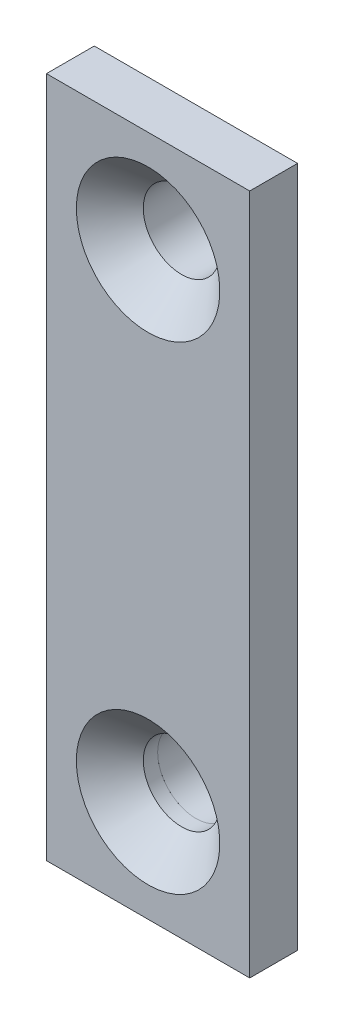
ISO-10303-21;
HEADER;
FILE_DESCRIPTION(('STEP AP214'),'2;1');
FILE_NAME('part.step','',(''),(''),'','','');
FILE_SCHEMA(('AUTOMOTIVE_DESIGN { 1 0 10303 214 1 1 1 1 }'));
ENDSEC;
DATA;
#1=APPLICATION_CONTEXT('core data for automotive mechanical design processes');
#2=APPLICATION_PROTOCOL_DEFINITION('international standard','automotive_design',2000,#1);
#3=PRODUCT_CONTEXT('',#1,'mechanical');
#4=PRODUCT('Part','Part','',(#3));
#5=PRODUCT_RELATED_PRODUCT_CATEGORY('part','',(#4));
#6=PRODUCT_DEFINITION_FORMATION('','',#4);
#7=PRODUCT_DEFINITION_CONTEXT('part definition',#1,'design');
#8=PRODUCT_DEFINITION('design','',#6,#7);
#9=PRODUCT_DEFINITION_SHAPE('','',#8);
#10=(LENGTH_UNIT() NAMED_UNIT(*) SI_UNIT(.MILLI.,.METRE.));
#11=(NAMED_UNIT(*) PLANE_ANGLE_UNIT() SI_UNIT($,.RADIAN.));
#12=(NAMED_UNIT(*) SI_UNIT($,.STERADIAN.) SOLID_ANGLE_UNIT());
#13=UNCERTAINTY_MEASURE_WITH_UNIT(LENGTH_MEASURE(1.E-05),#10,'distance_accuracy_value','');
#14=(GEOMETRIC_REPRESENTATION_CONTEXT(3) GLOBAL_UNCERTAINTY_ASSIGNED_CONTEXT((#13)) GLOBAL_UNIT_ASSIGNED_CONTEXT((#10,
#11,#12)) REPRESENTATION_CONTEXT('',''));
#15=CARTESIAN_POINT('',(0.,0.,0.));
#16=DIRECTION('',(0.,0.,1.));
#17=DIRECTION('',(1.,0.,0.));
#18=AXIS2_PLACEMENT_3D('',#15,#16,#17);
#19=CARTESIAN_POINT('',(0.,-7.5,2.));
#20=DIRECTION('',(0.,1.,0.));
#21=DIRECTION('',(0.,0.,1.));
#22=AXIS2_PLACEMENT_3D('',#19,#20,#21);
#23=PLANE('',#22);
#24=DIRECTION('',(1.,0.,0.));
#25=VECTOR('',#24,1.);
#26=CARTESIAN_POINT('',(0.,-7.5,0.));
#27=LINE('',#26,#25);
#28=CARTESIAN_POINT('',(-2.25,-7.5,0.));
#29=VERTEX_POINT('',#28);
#30=CARTESIAN_POINT('',(2.25,-7.5,0.));
#31=VERTEX_POINT('',#30);
#32=EDGE_CURVE('E156',#29,#31,#27,.T.);
#33=ORIENTED_EDGE('',*,*,#32,.F.);
#34=DIRECTION('',(0.,0.,-1.));
#35=VECTOR('',#34,1.);
#36=CARTESIAN_POINT('',(-2.25,-7.5,2.));
#37=LINE('',#36,#35);
#38=CARTESIAN_POINT('',(-2.25,-7.5,2.));
#39=VERTEX_POINT('',#38);
#40=EDGE_CURVE('E13',#39,#29,#37,.T.);
#41=ORIENTED_EDGE('',*,*,#40,.F.);
#42=DIRECTION('',(1.,0.,0.));
#43=VECTOR('',#42,1.);
#44=CARTESIAN_POINT('',(0.,-7.5,2.));
#45=LINE('',#44,#43);
#46=CARTESIAN_POINT('',(2.25,-7.5,2.));
#47=VERTEX_POINT('',#46);
#48=EDGE_CURVE('E146',#39,#47,#45,.T.);
#49=ORIENTED_EDGE('',*,*,#48,.T.);
#50=DIRECTION('',(0.,0.,-1.));
#51=VECTOR('',#50,1.);
#52=CARTESIAN_POINT('',(2.25,-7.5,2.));
#53=LINE('',#52,#51);
#54=EDGE_CURVE('E125',#47,#31,#53,.T.);
#55=ORIENTED_EDGE('',*,*,#54,.T.);
#56=EDGE_LOOP('',(#33,#41,#49,#55));
#57=FACE_BOUND('',#56,.T.);
#58=ADVANCED_FACE('F85',(#57),#23,.T.);
#59=CARTESIAN_POINT('',(-2.25,0.,2.));
#60=DIRECTION('',(-1.,0.,0.));
#61=DIRECTION('',(0.,0.,1.));
#62=AXIS2_PLACEMENT_3D('',#59,#60,#61);
#63=PLANE('',#62);
#64=DIRECTION('',(0.,1.,0.));
#65=VECTOR('',#64,1.);
#66=CARTESIAN_POINT('',(-2.25,0.,0.));
#67=LINE('',#66,#65);
#68=CARTESIAN_POINT('',(-2.25,-12.25,0.));
#69=VERTEX_POINT('',#68);
#70=EDGE_CURVE('E137',#69,#29,#67,.T.);
#71=ORIENTED_EDGE('',*,*,#70,.F.);
#72=DIRECTION('',(0.,0.,-1.));
#73=VECTOR('',#72,1.);
#74=CARTESIAN_POINT('',(-2.25,-12.25,2.));
#75=LINE('',#74,#73);
#76=CARTESIAN_POINT('',(-2.25,-12.25,2.));
#77=VERTEX_POINT('',#76);
#78=EDGE_CURVE('E94',#77,#69,#75,.T.);
#79=ORIENTED_EDGE('',*,*,#78,.F.);
#80=DIRECTION('',(0.,1.,0.));
#81=VECTOR('',#80,1.);
#82=CARTESIAN_POINT('',(-2.25,0.,2.));
#83=LINE('',#82,#81);
#84=EDGE_CURVE('E135',#77,#39,#83,.T.);
#85=ORIENTED_EDGE('',*,*,#84,.T.);
#86=ORIENTED_EDGE('',*,*,#40,.T.);
#87=EDGE_LOOP('',(#71,#79,#85,#86));
#88=FACE_BOUND('',#87,.T.);
#89=ADVANCED_FACE('F133',(#88),#63,.T.);
#90=CARTESIAN_POINT('',(0.,-12.25,2.));
#91=DIRECTION('',(0.,1.,0.));
#92=DIRECTION('',(0.,0.,1.));
#93=AXIS2_PLACEMENT_3D('',#90,#91,#92);
#94=PLANE('',#93);
#95=DIRECTION('',(1.,0.,0.));
#96=VECTOR('',#95,1.);
#97=CARTESIAN_POINT('',(0.,-12.25,0.));
#98=LINE('',#97,#96);
#99=CARTESIAN_POINT('',(2.25,-12.25,0.));
#100=VERTEX_POINT('',#99);
#101=EDGE_CURVE('E159',#69,#100,#98,.T.);
#102=ORIENTED_EDGE('',*,*,#101,.T.);
#103=DIRECTION('',(0.,0.,-1.));
#104=VECTOR('',#103,1.);
#105=CARTESIAN_POINT('',(2.25,-12.25,2.));
#106=LINE('',#105,#104);
#107=CARTESIAN_POINT('',(2.25,-12.25,2.));
#108=VERTEX_POINT('',#107);
#109=EDGE_CURVE('E140',#108,#100,#106,.T.);
#110=ORIENTED_EDGE('',*,*,#109,.F.);
#111=DIRECTION('',(1.,0.,0.));
#112=VECTOR('',#111,1.);
#113=CARTESIAN_POINT('',(0.,-12.25,2.));
#114=LINE('',#113,#112);
#115=EDGE_CURVE('E142',#77,#108,#114,.T.);
#116=ORIENTED_EDGE('',*,*,#115,.F.);
#117=ORIENTED_EDGE('',*,*,#78,.T.);
#118=EDGE_LOOP('',(#102,#110,#116,#117));
#119=FACE_BOUND('',#118,.T.);
#120=ADVANCED_FACE('F143',(#119),#94,.F.);
#121=CARTESIAN_POINT('',(0.,-10.,2.));
#122=DIRECTION('',(0.,0.,-1.));
#123=DIRECTION('',(-1.,0.,0.));
#124=AXIS2_PLACEMENT_3D('',#121,#122,#123);
#125=CYLINDRICAL_SURFACE('',#124,1.6);
#126=CARTESIAN_POINT('',(0.,-10.,2.));
#127=DIRECTION('',(0.,0.,1.));
#128=DIRECTION('',(1.,0.,0.));
#129=AXIS2_PLACEMENT_3D('',#126,#127,#128);
#130=CIRCLE('',#129,1.6);
#131=CARTESIAN_POINT('',(1.6,-10.,2.));
#132=VERTEX_POINT('',#131);
#133=EDGE_CURVE('E148',#132,#132,#130,.T.);
#134=ORIENTED_EDGE('',*,*,#133,.T.);
#135=EDGE_LOOP('',(#134));
#136=FACE_BOUND('',#135,.T.);
#137=CARTESIAN_POINT('',(0.,-10.,0.));
#138=DIRECTION('',(0.,0.,1.));
#139=DIRECTION('',(1.,0.,0.));
#140=AXIS2_PLACEMENT_3D('',#137,#138,#139);
#141=CIRCLE('',#140,1.6);
#142=CARTESIAN_POINT('',(1.6,-10.,0.));
#143=VERTEX_POINT('',#142);
#144=EDGE_CURVE('E153',#143,#143,#141,.T.);
#145=ORIENTED_EDGE('',*,*,#144,.F.);
#146=EDGE_LOOP('',(#145));
#147=FACE_BOUND('',#146,.T.);
#148=ADVANCED_FACE('F87',(#136,#147),#125,.F.);
#149=CARTESIAN_POINT('',(2.25,0.,2.));
#150=DIRECTION('',(-1.,0.,0.));
#151=DIRECTION('',(0.,0.,1.));
#152=AXIS2_PLACEMENT_3D('',#149,#150,#151);
#153=PLANE('',#152);
#154=DIRECTION('',(0.,1.,0.));
#155=VECTOR('',#154,1.);
#156=CARTESIAN_POINT('',(2.25,0.,0.));
#157=LINE('',#156,#155);
#158=EDGE_CURVE('E118',#100,#31,#157,.T.);
#159=ORIENTED_EDGE('',*,*,#158,.T.);
#160=ORIENTED_EDGE('',*,*,#54,.F.);
#161=DIRECTION('',(0.,1.,0.));
#162=VECTOR('',#161,1.);
#163=CARTESIAN_POINT('',(2.25,0.,2.));
#164=LINE('',#163,#162);
#165=EDGE_CURVE('E102',#108,#47,#164,.T.);
#166=ORIENTED_EDGE('',*,*,#165,.F.);
#167=ORIENTED_EDGE('',*,*,#109,.T.);
#168=EDGE_LOOP('',(#159,#160,#166,#167));
#169=FACE_BOUND('',#168,.T.);
#170=ADVANCED_FACE('F164',(#169),#153,.F.);
#171=CARTESIAN_POINT('',(0.,0.,2.));
#172=DIRECTION('',(0.,0.,1.));
#173=DIRECTION('',(1.,0.,0.));
#174=AXIS2_PLACEMENT_3D('',#171,#172,#173);
#175=PLANE('',#174);
#176=ORIENTED_EDGE('',*,*,#133,.F.);
#177=EDGE_LOOP('',(#176));
#178=FACE_BOUND('',#177,.T.);
#179=ORIENTED_EDGE('',*,*,#48,.F.);
#180=ORIENTED_EDGE('',*,*,#84,.F.);
#181=ORIENTED_EDGE('',*,*,#115,.T.);
#182=ORIENTED_EDGE('',*,*,#165,.T.);
#183=EDGE_LOOP('',(#179,#180,#181,#182));
#184=FACE_BOUND('',#183,.T.);
#185=ADVANCED_FACE('F145',(#178,#184),#175,.T.);
#186=CARTESIAN_POINT('',(0.,0.,0.));
#187=DIRECTION('',(0.,0.,1.));
#188=DIRECTION('',(1.,0.,0.));
#189=AXIS2_PLACEMENT_3D('',#186,#187,#188);
#190=PLANE('',#189);
#191=ORIENTED_EDGE('',*,*,#144,.T.);
#192=EDGE_LOOP('',(#191));
#193=FACE_BOUND('',#192,.T.);
#194=ORIENTED_EDGE('',*,*,#32,.T.);
#195=ORIENTED_EDGE('',*,*,#158,.F.);
#196=ORIENTED_EDGE('',*,*,#101,.F.);
#197=ORIENTED_EDGE('',*,*,#70,.T.);
#198=EDGE_LOOP('',(#194,#195,#196,#197));
#199=FACE_BOUND('',#198,.T.);
#200=ADVANCED_FACE('F165',(#193,#199),#190,.F.);
#201=CLOSED_SHELL('',(#58,#89,#120,#148,#170,#185,#200));
#202=MANIFOLD_SOLID_BREP('B2',#201);
#203=CARTESIAN_POINT('',(-2.25,0.,2.));
#204=DIRECTION('',(-1.,0.,0.));
#205=DIRECTION('',(0.,0.,1.));
#206=AXIS2_PLACEMENT_3D('',#203,#204,#205);
#207=PLANE('',#206);
#208=DIRECTION('',(0.,1.,0.));
#209=VECTOR('',#208,1.);
#210=CARTESIAN_POINT('',(-2.25,0.,0.));
#211=LINE('',#210,#209);
#212=CARTESIAN_POINT('',(-2.25,7.5,0.));
#213=VERTEX_POINT('',#212);
#214=CARTESIAN_POINT('',(-2.25,12.25,0.));
#215=VERTEX_POINT('',#214);
#216=EDGE_CURVE('E287',#213,#215,#211,.T.);
#217=ORIENTED_EDGE('',*,*,#216,.F.);
#218=DIRECTION('',(0.,0.,-1.));
#219=VECTOR('',#218,1.);
#220=CARTESIAN_POINT('',(-2.25,7.5,2.));
#221=LINE('',#220,#219);
#222=CARTESIAN_POINT('',(-2.25,7.5,2.));
#223=VERTEX_POINT('',#222);
#224=EDGE_CURVE('E297',#223,#213,#221,.T.);
#225=ORIENTED_EDGE('',*,*,#224,.F.);
#226=DIRECTION('',(0.,1.,0.));
#227=VECTOR('',#226,1.);
#228=CARTESIAN_POINT('',(-2.25,0.,2.));
#229=LINE('',#228,#227);
#230=CARTESIAN_POINT('',(-2.25,12.25,2.));
#231=VERTEX_POINT('',#230);
#232=EDGE_CURVE('E288',#223,#231,#229,.T.);
#233=ORIENTED_EDGE('',*,*,#232,.T.);
#234=DIRECTION('',(0.,0.,-1.));
#235=VECTOR('',#234,1.);
#236=CARTESIAN_POINT('',(-2.25,12.25,2.));
#237=LINE('',#236,#235);
#238=EDGE_CURVE('E273',#231,#215,#237,.T.);
#239=ORIENTED_EDGE('',*,*,#238,.T.);
#240=EDGE_LOOP('',(#217,#225,#233,#239));
#241=FACE_BOUND('',#240,.T.);
#242=ADVANCED_FACE('F230',(#241),#207,.T.);
#243=CARTESIAN_POINT('',(0.,7.5,2.));
#244=DIRECTION('',(0.,1.,0.));
#245=DIRECTION('',(0.,0.,1.));
#246=AXIS2_PLACEMENT_3D('',#243,#244,#245);
#247=PLANE('',#246);
#248=DIRECTION('',(1.,0.,0.));
#249=VECTOR('',#248,1.);
#250=CARTESIAN_POINT('',(0.,7.5,0.));
#251=LINE('',#250,#249);
#252=CARTESIAN_POINT('',(2.25,7.5,0.));
#253=VERTEX_POINT('',#252);
#254=EDGE_CURVE('E282',#213,#253,#251,.T.);
#255=ORIENTED_EDGE('',*,*,#254,.T.);
#256=DIRECTION('',(0.,0.,-1.));
#257=VECTOR('',#256,1.);
#258=CARTESIAN_POINT('',(2.25,7.5,2.));
#259=LINE('',#258,#257);
#260=CARTESIAN_POINT('',(2.25,7.5,2.));
#261=VERTEX_POINT('',#260);
#262=EDGE_CURVE('E272',#261,#253,#259,.T.);
#263=ORIENTED_EDGE('',*,*,#262,.F.);
#264=DIRECTION('',(1.,0.,0.));
#265=VECTOR('',#264,1.);
#266=CARTESIAN_POINT('',(0.,7.5,2.));
#267=LINE('',#266,#265);
#268=EDGE_CURVE('E291',#223,#261,#267,.T.);
#269=ORIENTED_EDGE('',*,*,#268,.F.);
#270=ORIENTED_EDGE('',*,*,#224,.T.);
#271=EDGE_LOOP('',(#255,#263,#269,#270));
#272=FACE_BOUND('',#271,.T.);
#273=ADVANCED_FACE('F333',(#272),#247,.F.);
#274=CARTESIAN_POINT('',(2.25,0.,2.));
#275=DIRECTION('',(-1.,0.,0.));
#276=DIRECTION('',(0.,0.,1.));
#277=AXIS2_PLACEMENT_3D('',#274,#275,#276);
#278=PLANE('',#277);
#279=DIRECTION('',(0.,1.,0.));
#280=VECTOR('',#279,1.);
#281=CARTESIAN_POINT('',(2.25,0.,0.));
#282=LINE('',#281,#280);
#283=CARTESIAN_POINT('',(2.25,12.25,0.));
#284=VERTEX_POINT('',#283);
#285=EDGE_CURVE('E276',#253,#284,#282,.T.);
#286=ORIENTED_EDGE('',*,*,#285,.T.);
#287=DIRECTION('',(0.,0.,-1.));
#288=VECTOR('',#287,1.);
#289=CARTESIAN_POINT('',(2.25,12.25,2.));
#290=LINE('',#289,#288);
#291=CARTESIAN_POINT('',(2.25,12.25,2.));
#292=VERTEX_POINT('',#291);
#293=EDGE_CURVE('E264',#292,#284,#290,.T.);
#294=ORIENTED_EDGE('',*,*,#293,.F.);
#295=DIRECTION('',(0.,1.,0.));
#296=VECTOR('',#295,1.);
#297=CARTESIAN_POINT('',(2.25,0.,2.));
#298=LINE('',#297,#296);
#299=EDGE_CURVE('E247',#261,#292,#298,.T.);
#300=ORIENTED_EDGE('',*,*,#299,.F.);
#301=ORIENTED_EDGE('',*,*,#262,.T.);
#302=EDGE_LOOP('',(#286,#294,#300,#301));
#303=FACE_BOUND('',#302,.T.);
#304=ADVANCED_FACE('F277',(#303),#278,.F.);
#305=CARTESIAN_POINT('',(0.,10.,2.));
#306=DIRECTION('',(0.,0.,-1.));
#307=DIRECTION('',(-1.,0.,0.));
#308=AXIS2_PLACEMENT_3D('',#305,#306,#307);
#309=CYLINDRICAL_SURFACE('',#308,1.6);
#310=CARTESIAN_POINT('',(0.,10.,2.6));
#311=DIRECTION('',(0.,0.,-1.));
#312=DIRECTION('',(-1.,0.,0.));
#313=AXIS2_PLACEMENT_3D('',#310,#311,#312);
#314=CIRCLE('',#313,1.6);
#315=CARTESIAN_POINT('',(-1.6,10.,2.6));
#316=VERTEX_POINT('',#315);
#317=EDGE_CURVE('E299',#316,#316,#314,.F.);
#318=ORIENTED_EDGE('',*,*,#317,.T.);
#319=EDGE_LOOP('',(#318));
#320=FACE_BOUND('',#319,.T.);
#321=CARTESIAN_POINT('',(0.,10.,0.));
#322=DIRECTION('',(0.,0.,1.));
#323=DIRECTION('',(1.,0.,0.));
#324=AXIS2_PLACEMENT_3D('',#321,#322,#323);
#325=CIRCLE('',#324,1.6);
#326=CARTESIAN_POINT('',(1.6,10.,0.));
#327=VERTEX_POINT('',#326);
#328=EDGE_CURVE('E322',#327,#327,#325,.T.);
#329=ORIENTED_EDGE('',*,*,#328,.F.);
#330=EDGE_LOOP('',(#329));
#331=FACE_BOUND('',#330,.T.);
#332=ADVANCED_FACE('F316',(#320,#331),#309,.F.);
#333=CARTESIAN_POINT('',(0.,12.25,2.));
#334=DIRECTION('',(0.,1.,0.));
#335=DIRECTION('',(0.,0.,1.));
#336=AXIS2_PLACEMENT_3D('',#333,#334,#335);
#337=PLANE('',#336);
#338=DIRECTION('',(1.,0.,0.));
#339=VECTOR('',#338,1.);
#340=CARTESIAN_POINT('',(0.,12.25,0.));
#341=LINE('',#340,#339);
#342=EDGE_CURVE('E269',#215,#284,#341,.T.);
#343=ORIENTED_EDGE('',*,*,#342,.F.);
#344=ORIENTED_EDGE('',*,*,#238,.F.);
#345=DIRECTION('',(1.,0.,0.));
#346=VECTOR('',#345,1.);
#347=CARTESIAN_POINT('',(0.,12.25,2.));
#348=LINE('',#347,#346);
#349=EDGE_CURVE('E270',#231,#292,#348,.T.);
#350=ORIENTED_EDGE('',*,*,#349,.T.);
#351=ORIENTED_EDGE('',*,*,#293,.T.);
#352=EDGE_LOOP('',(#343,#344,#350,#351));
#353=FACE_BOUND('',#352,.T.);
#354=ADVANCED_FACE('F266',(#353),#337,.T.);
#355=CARTESIAN_POINT('',(0.,0.,0.));
#356=DIRECTION('',(0.,0.,1.));
#357=DIRECTION('',(1.,0.,0.));
#358=AXIS2_PLACEMENT_3D('',#355,#356,#357);
#359=PLANE('',#358);
#360=ORIENTED_EDGE('',*,*,#328,.T.);
#361=EDGE_LOOP('',(#360));
#362=FACE_BOUND('',#361,.T.);
#363=ORIENTED_EDGE('',*,*,#216,.T.);
#364=ORIENTED_EDGE('',*,*,#342,.T.);
#365=ORIENTED_EDGE('',*,*,#285,.F.);
#366=ORIENTED_EDGE('',*,*,#254,.F.);
#367=EDGE_LOOP('',(#363,#364,#365,#366));
#368=FACE_BOUND('',#367,.T.);
#369=ADVANCED_FACE('F285',(#362,#368),#359,.F.);
#370=CARTESIAN_POINT('',(0.,0.,2.));
#371=DIRECTION('',(0.,0.,-1.));
#372=DIRECTION('',(-1.,0.,0.));
#373=AXIS2_PLACEMENT_3D('',#370,#371,#372);
#374=PLANE('',#373);
#375=DIRECTION('',(0.,-1.,0.));
#376=VECTOR('',#375,1.);
#377=CARTESIAN_POINT('',(4.25,0.,2.));
#378=LINE('',#377,#376);
#379=CARTESIAN_POINT('',(4.25,14.25,2.));
#380=VERTEX_POINT('',#379);
#381=CARTESIAN_POINT('',(4.25,-14.25,2.));
#382=VERTEX_POINT('',#381);
#383=EDGE_CURVE('E398',#380,#382,#378,.T.);
#384=ORIENTED_EDGE('',*,*,#383,.T.);
#385=DIRECTION('',(-1.,0.,0.));
#386=VECTOR('',#385,1.);
#387=CARTESIAN_POINT('',(0.,-14.25,2.));
#388=LINE('',#387,#386);
#389=CARTESIAN_POINT('',(-4.25,-14.25,2.));
#390=VERTEX_POINT('',#389);
#391=EDGE_CURVE('E372',#382,#390,#388,.T.);
#392=ORIENTED_EDGE('',*,*,#391,.T.);
#393=DIRECTION('',(0.,-1.,0.));
#394=VECTOR('',#393,1.);
#395=CARTESIAN_POINT('',(-4.25,0.,2.));
#396=LINE('',#395,#394);
#397=CARTESIAN_POINT('',(-4.25,14.25,2.));
#398=VERTEX_POINT('',#397);
#399=EDGE_CURVE('E391',#398,#390,#396,.T.);
#400=ORIENTED_EDGE('',*,*,#399,.F.);
#401=DIRECTION('',(-1.,0.,0.));
#402=VECTOR('',#401,1.);
#403=CARTESIAN_POINT('',(0.,14.25,2.));
#404=LINE('',#403,#402);
#405=EDGE_CURVE('E389',#380,#398,#404,.T.);
#406=ORIENTED_EDGE('',*,*,#405,.F.);
#407=EDGE_LOOP('',(#384,#392,#400,#406));
#408=FACE_BOUND('',#407,.T.);
#409=CARTESIAN_POINT('',(0.,-10.,2.));
#410=DIRECTION('',(0.,0.,1.));
#411=DIRECTION('',(1.,0.,0.));
#412=AXIS2_PLACEMENT_3D('',#409,#410,#411);
#413=CIRCLE('',#412,1.6);
#414=CARTESIAN_POINT('',(1.6,-10.,2.));
#415=VERTEX_POINT('',#414);
#416=EDGE_CURVE('E394',#415,#415,#413,.T.);
#417=ORIENTED_EDGE('',*,*,#416,.T.);
#418=EDGE_LOOP('',(#417));
#419=FACE_BOUND('',#418,.T.);
#420=ORIENTED_EDGE('',*,*,#232,.F.);
#421=ORIENTED_EDGE('',*,*,#268,.T.);
#422=ORIENTED_EDGE('',*,*,#299,.T.);
#423=ORIENTED_EDGE('',*,*,#349,.F.);
#424=EDGE_LOOP('',(#420,#421,#422,#423));
#425=FACE_BOUND('',#424,.T.);
#426=ADVANCED_FACE('F406',(#408,#419,#425),#374,.T.);
#427=CARTESIAN_POINT('',(0.,0.,4.));
#428=DIRECTION('',(0.,0.,-1.));
#429=DIRECTION('',(-1.,0.,0.));
#430=AXIS2_PLACEMENT_3D('',#427,#428,#429);
#431=PLANE('',#430);
#432=CARTESIAN_POINT('',(0.,10.,4.));
#433=DIRECTION('',(0.,0.,-1.));
#434=DIRECTION('',(-1.,0.,0.));
#435=AXIS2_PLACEMENT_3D('',#432,#433,#434);
#436=CIRCLE('',#435,3.00000000000001);
#437=CARTESIAN_POINT('',(-3.00000000000001,10.,4.));
#438=VERTEX_POINT('',#437);
#439=EDGE_CURVE('E240',#438,#438,#436,.T.);
#440=ORIENTED_EDGE('',*,*,#439,.T.);
#441=EDGE_LOOP('',(#440));
#442=FACE_BOUND('',#441,.T.);
#443=CARTESIAN_POINT('',(0.,-10.,4.));
#444=DIRECTION('',(0.,0.,-1.));
#445=DIRECTION('',(-1.,0.,0.));
#446=AXIS2_PLACEMENT_3D('',#443,#444,#445);
#447=CIRCLE('',#446,3.00000000000001);
#448=CARTESIAN_POINT('',(-3.00000000000001,-10.,4.));
#449=VERTEX_POINT('',#448);
#450=EDGE_CURVE('E302',#449,#449,#447,.T.);
#451=ORIENTED_EDGE('',*,*,#450,.T.);
#452=EDGE_LOOP('',(#451));
#453=FACE_BOUND('',#452,.T.);
#454=DIRECTION('',(0.,-1.,0.));
#455=VECTOR('',#454,1.);
#456=CARTESIAN_POINT('',(4.25,0.,4.));
#457=LINE('',#456,#455);
#458=CARTESIAN_POINT('',(4.25,14.25,4.));
#459=VERTEX_POINT('',#458);
#460=CARTESIAN_POINT('',(4.25,-14.25,4.));
#461=VERTEX_POINT('',#460);
#462=EDGE_CURVE('E382',#459,#461,#457,.T.);
#463=ORIENTED_EDGE('',*,*,#462,.F.);
#464=DIRECTION('',(-1.,0.,0.));
#465=VECTOR('',#464,1.);
#466=CARTESIAN_POINT('',(0.,14.25,4.));
#467=LINE('',#466,#465);
#468=CARTESIAN_POINT('',(-4.25,14.25,4.));
#469=VERTEX_POINT('',#468);
#470=EDGE_CURVE('E378',#459,#469,#467,.T.);
#471=ORIENTED_EDGE('',*,*,#470,.T.);
#472=DIRECTION('',(0.,-1.,0.));
#473=VECTOR('',#472,1.);
#474=CARTESIAN_POINT('',(-4.25,0.,4.));
#475=LINE('',#474,#473);
#476=CARTESIAN_POINT('',(-4.25,-14.25,4.));
#477=VERTEX_POINT('',#476);
#478=EDGE_CURVE('E384',#469,#477,#475,.T.);
#479=ORIENTED_EDGE('',*,*,#478,.T.);
#480=DIRECTION('',(-1.,0.,0.));
#481=VECTOR('',#480,1.);
#482=CARTESIAN_POINT('',(0.,-14.25,4.));
#483=LINE('',#482,#481);
#484=EDGE_CURVE('E370',#461,#477,#483,.T.);
#485=ORIENTED_EDGE('',*,*,#484,.F.);
#486=EDGE_LOOP('',(#463,#471,#479,#485));
#487=FACE_BOUND('',#486,.T.);
#488=ADVANCED_FACE('F307',(#442,#453,#487),#431,.F.);
#489=CARTESIAN_POINT('',(4.25,0.,4.));
#490=DIRECTION('',(1.,0.,0.));
#491=DIRECTION('',(0.,0.,-1.));
#492=AXIS2_PLACEMENT_3D('',#489,#490,#491);
#493=PLANE('',#492);
#494=ORIENTED_EDGE('',*,*,#383,.F.);
#495=DIRECTION('',(0.,0.,-1.));
#496=VECTOR('',#495,1.);
#497=CARTESIAN_POINT('',(4.25,14.25,4.));
#498=LINE('',#497,#496);
#499=EDGE_CURVE('E324',#459,#380,#498,.T.);
#500=ORIENTED_EDGE('',*,*,#499,.F.);
#501=ORIENTED_EDGE('',*,*,#462,.T.);
#502=DIRECTION('',(0.,0.,-1.));
#503=VECTOR('',#502,1.);
#504=CARTESIAN_POINT('',(4.25,-14.25,4.));
#505=LINE('',#504,#503);
#506=EDGE_CURVE('E367',#461,#382,#505,.T.);
#507=ORIENTED_EDGE('',*,*,#506,.T.);
#508=EDGE_LOOP('',(#494,#500,#501,#507));
#509=FACE_BOUND('',#508,.T.);
#510=ADVANCED_FACE('F387',(#509),#493,.T.);
#511=CARTESIAN_POINT('',(0.,14.25,4.));
#512=DIRECTION('',(0.,-1.,0.));
#513=DIRECTION('',(1.,0.,0.));
#514=AXIS2_PLACEMENT_3D('',#511,#512,#513);
#515=PLANE('',#514);
#516=ORIENTED_EDGE('',*,*,#405,.T.);
#517=DIRECTION('',(0.,0.,-1.));
#518=VECTOR('',#517,1.);
#519=CARTESIAN_POINT('',(-4.25,14.25,4.));
#520=LINE('',#519,#518);
#521=EDGE_CURVE('E328',#469,#398,#520,.T.);
#522=ORIENTED_EDGE('',*,*,#521,.F.);
#523=ORIENTED_EDGE('',*,*,#470,.F.);
#524=ORIENTED_EDGE('',*,*,#499,.T.);
#525=EDGE_LOOP('',(#516,#522,#523,#524));
#526=FACE_BOUND('',#525,.T.);
#527=ADVANCED_FACE('F436',(#526),#515,.F.);
#528=CARTESIAN_POINT('',(-4.25,0.,4.));
#529=DIRECTION('',(1.,0.,0.));
#530=DIRECTION('',(0.,0.,-1.));
#531=AXIS2_PLACEMENT_3D('',#528,#529,#530);
#532=PLANE('',#531);
#533=ORIENTED_EDGE('',*,*,#399,.T.);
#534=DIRECTION('',(0.,0.,-1.));
#535=VECTOR('',#534,1.);
#536=CARTESIAN_POINT('',(-4.25,-14.25,4.));
#537=LINE('',#536,#535);
#538=EDGE_CURVE('E377',#477,#390,#537,.T.);
#539=ORIENTED_EDGE('',*,*,#538,.F.);
#540=ORIENTED_EDGE('',*,*,#478,.F.);
#541=ORIENTED_EDGE('',*,*,#521,.T.);
#542=EDGE_LOOP('',(#533,#539,#540,#541));
#543=FACE_BOUND('',#542,.T.);
#544=ADVANCED_FACE('F439',(#543),#532,.F.);
#545=CARTESIAN_POINT('',(0.,-14.25,4.));
#546=DIRECTION('',(0.,-1.,0.));
#547=DIRECTION('',(1.,0.,0.));
#548=AXIS2_PLACEMENT_3D('',#545,#546,#547);
#549=PLANE('',#548);
#550=ORIENTED_EDGE('',*,*,#391,.F.);
#551=ORIENTED_EDGE('',*,*,#506,.F.);
#552=ORIENTED_EDGE('',*,*,#484,.T.);
#553=ORIENTED_EDGE('',*,*,#538,.T.);
#554=EDGE_LOOP('',(#550,#551,#552,#553));
#555=FACE_BOUND('',#554,.T.);
#556=ADVANCED_FACE('F369',(#555),#549,.T.);
#557=CARTESIAN_POINT('',(0.,-10.,4.));
#558=DIRECTION('',(0.,0.,-1.));
#559=DIRECTION('',(-1.,0.,0.));
#560=AXIS2_PLACEMENT_3D('',#557,#558,#559);
#561=CYLINDRICAL_SURFACE('',#560,1.6);
#562=CARTESIAN_POINT('',(0.,-10.,2.6));
#563=DIRECTION('',(0.,0.,-1.));
#564=DIRECTION('',(-1.,0.,0.));
#565=AXIS2_PLACEMENT_3D('',#562,#563,#564);
#566=CIRCLE('',#565,1.6);
#567=CARTESIAN_POINT('',(-1.6,-10.,2.6));
#568=VERTEX_POINT('',#567);
#569=EDGE_CURVE('E83',#568,#568,#566,.F.);
#570=ORIENTED_EDGE('',*,*,#569,.T.);
#571=EDGE_LOOP('',(#570));
#572=FACE_BOUND('',#571,.T.);
#573=ORIENTED_EDGE('',*,*,#416,.F.);
#574=EDGE_LOOP('',(#573));
#575=FACE_BOUND('',#574,.T.);
#576=ADVANCED_FACE('F313',(#572,#575),#561,.F.);
#577=CARTESIAN_POINT('',(0.,10.,2.6));
#578=DIRECTION('',(0.,0.,1.));
#579=DIRECTION('',(1.,0.,0.));
#580=AXIS2_PLACEMENT_3D('',#577,#578,#579);
#581=CONICAL_SURFACE('',#580,1.6,0.785398163397451);
#582=ORIENTED_EDGE('',*,*,#439,.F.);
#583=EDGE_LOOP('',(#582));
#584=FACE_BOUND('',#583,.T.);
#585=ORIENTED_EDGE('',*,*,#317,.F.);
#586=EDGE_LOOP('',(#585));
#587=FACE_BOUND('',#586,.T.);
#588=ADVANCED_FACE('F310',(#584,#587),#581,.F.);
#589=CARTESIAN_POINT('',(0.,-10.,2.6));
#590=DIRECTION('',(0.,0.,1.));
#591=DIRECTION('',(1.,0.,0.));
#592=AXIS2_PLACEMENT_3D('',#589,#590,#591);
#593=CONICAL_SURFACE('',#592,1.6,0.785398163397451);
#594=ORIENTED_EDGE('',*,*,#450,.F.);
#595=EDGE_LOOP('',(#594));
#596=FACE_BOUND('',#595,.T.);
#597=ORIENTED_EDGE('',*,*,#569,.F.);
#598=EDGE_LOOP('',(#597));
#599=FACE_BOUND('',#598,.T.);
#600=ADVANCED_FACE('F233',(#596,#599),#593,.F.);
#601=CLOSED_SHELL('',(#242,#273,#304,#332,#354,#369,#426,#488,#510,#527,#544,#556,#576,#588,#600));
#602=MANIFOLD_SOLID_BREP('B7',#601);
#603=ADVANCED_BREP_SHAPE_REPRESENTATION('',(#18,#202,#602),#14);
#604=SHAPE_DEFINITION_REPRESENTATION(#9,#603);
ENDSEC;
END-ISO-10303-21;
